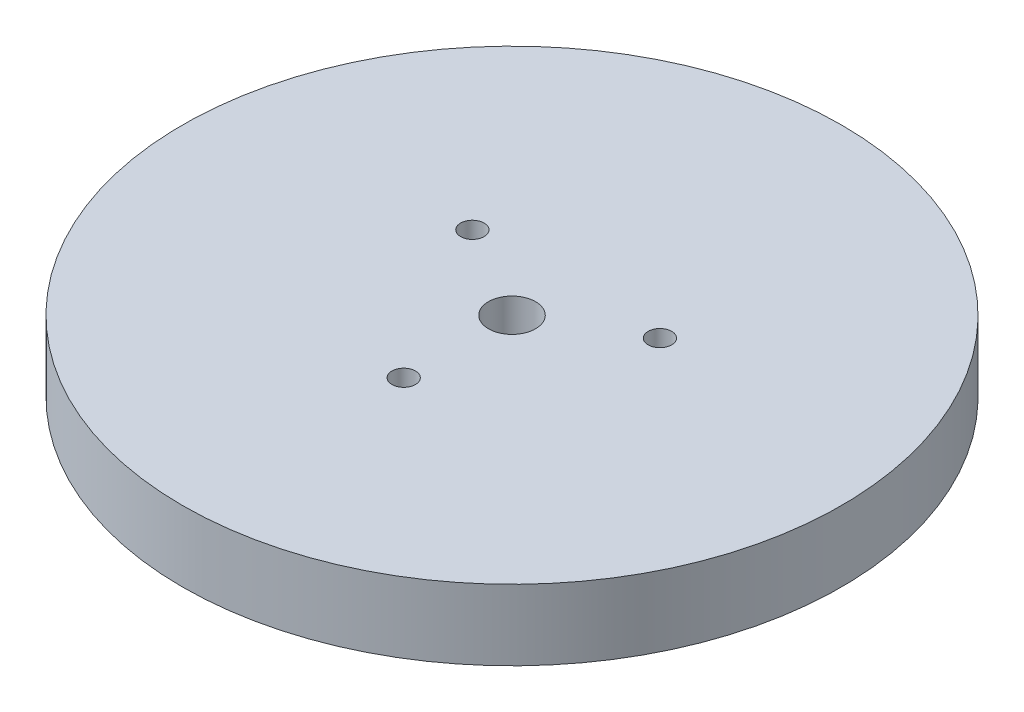
ISO-10303-21;
HEADER;
FILE_DESCRIPTION(('STEP AP214'),'2;1');
FILE_NAME('part.step','',(''),(''),'','','');
FILE_SCHEMA(('AUTOMOTIVE_DESIGN { 1 0 10303 214 1 1 1 1 }'));
ENDSEC;
DATA;
#1=APPLICATION_CONTEXT('core data for automotive mechanical design processes');
#2=APPLICATION_PROTOCOL_DEFINITION('international standard','automotive_design',2000,#1);
#3=PRODUCT_CONTEXT('',#1,'mechanical');
#4=PRODUCT('Part','Part','',(#3));
#5=PRODUCT_RELATED_PRODUCT_CATEGORY('part','',(#4));
#6=PRODUCT_DEFINITION_FORMATION('','',#4);
#7=PRODUCT_DEFINITION_CONTEXT('part definition',#1,'design');
#8=PRODUCT_DEFINITION('design','',#6,#7);
#9=PRODUCT_DEFINITION_SHAPE('','',#8);
#10=(LENGTH_UNIT() NAMED_UNIT(*) SI_UNIT(.MILLI.,.METRE.));
#11=(NAMED_UNIT(*) PLANE_ANGLE_UNIT() SI_UNIT($,.RADIAN.));
#12=(NAMED_UNIT(*) SI_UNIT($,.STERADIAN.) SOLID_ANGLE_UNIT());
#13=UNCERTAINTY_MEASURE_WITH_UNIT(LENGTH_MEASURE(1.E-05),#10,'distance_accuracy_value','');
#14=(GEOMETRIC_REPRESENTATION_CONTEXT(3) GLOBAL_UNCERTAINTY_ASSIGNED_CONTEXT((#13)) GLOBAL_UNIT_ASSIGNED_CONTEXT((#10,
#11,#12)) REPRESENTATION_CONTEXT('',''));
#15=CARTESIAN_POINT('',(0.,0.,0.));
#16=DIRECTION('',(0.,0.,1.));
#17=DIRECTION('',(1.,0.,0.));
#18=AXIS2_PLACEMENT_3D('',#15,#16,#17);
#19=CARTESIAN_POINT('',(0.,15.,0.));
#20=DIRECTION('',(0.,-1.,0.));
#21=DIRECTION('',(0.,0.,-1.));
#22=AXIS2_PLACEMENT_3D('',#19,#20,#21);
#23=CYLINDRICAL_SURFACE('',#22,70.);
#24=CARTESIAN_POINT('',(0.,15.,0.));
#25=DIRECTION('',(0.,1.,0.));
#26=DIRECTION('',(0.,0.,1.));
#27=AXIS2_PLACEMENT_3D('',#24,#25,#26);
#28=CIRCLE('',#27,70.);
#29=CARTESIAN_POINT('',(0.,15.,70.));
#30=VERTEX_POINT('',#29);
#31=EDGE_CURVE('E10',#30,#30,#28,.T.);
#32=ORIENTED_EDGE('',*,*,#31,.F.);
#33=EDGE_LOOP('',(#32));
#34=FACE_BOUND('',#33,.T.);
#35=CARTESIAN_POINT('',(0.,0.,0.));
#36=DIRECTION('',(0.,1.,0.));
#37=DIRECTION('',(0.,0.,1.));
#38=AXIS2_PLACEMENT_3D('',#35,#36,#37);
#39=CIRCLE('',#38,70.);
#40=CARTESIAN_POINT('',(0.,0.,70.));
#41=VERTEX_POINT('',#40);
#42=EDGE_CURVE('E36',#41,#41,#39,.T.);
#43=ORIENTED_EDGE('',*,*,#42,.T.);
#44=EDGE_LOOP('',(#43));
#45=FACE_BOUND('',#44,.T.);
#46=ADVANCED_FACE('F33',(#34,#45),#23,.T.);
#47=CARTESIAN_POINT('',(0.,15.,0.));
#48=DIRECTION('',(0.,1.,0.));
#49=DIRECTION('',(0.,0.,1.));
#50=AXIS2_PLACEMENT_3D('',#47,#48,#49);
#51=PLANE('',#50);
#52=CARTESIAN_POINT('',(0.,15.,23.));
#53=DIRECTION('',(0.,-1.,0.));
#54=DIRECTION('',(0.,0.,-1.));
#55=AXIS2_PLACEMENT_3D('',#52,#53,#54);
#56=CIRCLE('',#55,2.5);
#57=CARTESIAN_POINT('',(0.,15.,20.5));
#58=VERTEX_POINT('',#57);
#59=EDGE_CURVE('E48',#58,#58,#56,.T.);
#60=ORIENTED_EDGE('',*,*,#59,.T.);
#61=EDGE_LOOP('',(#60));
#62=FACE_BOUND('',#61,.T.);
#63=CARTESIAN_POINT('',(19.9185842870421,15.,-11.4999999999999));
#64=DIRECTION('',(0.,-1.,0.));
#65=DIRECTION('',(0.,0.,-1.));
#66=AXIS2_PLACEMENT_3D('',#63,#64,#65);
#67=CIRCLE('',#66,2.5);
#68=CARTESIAN_POINT('',(19.9185842870421,15.,-13.9999999999999));
#69=VERTEX_POINT('',#68);
#70=EDGE_CURVE('E60',#69,#69,#67,.T.);
#71=ORIENTED_EDGE('',*,*,#70,.T.);
#72=EDGE_LOOP('',(#71));
#73=FACE_BOUND('',#72,.T.);
#74=CARTESIAN_POINT('',(-19.9185842870421,15.,-11.5));
#75=DIRECTION('',(0.,-1.,0.));
#76=DIRECTION('',(0.,0.,-1.));
#77=AXIS2_PLACEMENT_3D('',#74,#75,#76);
#78=CIRCLE('',#77,2.5);
#79=CARTESIAN_POINT('',(-19.9185842870421,15.,-14.));
#80=VERTEX_POINT('',#79);
#81=EDGE_CURVE('E54',#80,#80,#78,.T.);
#82=ORIENTED_EDGE('',*,*,#81,.T.);
#83=EDGE_LOOP('',(#82));
#84=FACE_BOUND('',#83,.T.);
#85=CARTESIAN_POINT('',(0.,15.,0.));
#86=DIRECTION('',(0.,1.,0.));
#87=DIRECTION('',(0.,0.,1.));
#88=AXIS2_PLACEMENT_3D('',#85,#86,#87);
#89=CIRCLE('',#88,5.);
#90=CARTESIAN_POINT('',(0.,15.,5.));
#91=VERTEX_POINT('',#90);
#92=EDGE_CURVE('E45',#91,#91,#89,.T.);
#93=ORIENTED_EDGE('',*,*,#92,.F.);
#94=EDGE_LOOP('',(#93));
#95=FACE_BOUND('',#94,.T.);
#96=ORIENTED_EDGE('',*,*,#31,.T.);
#97=EDGE_LOOP('',(#96));
#98=FACE_BOUND('',#97,.T.);
#99=ADVANCED_FACE('F69',(#62,#73,#84,#95,#98),#51,.T.);
#100=CARTESIAN_POINT('',(0.,0.,0.));
#101=DIRECTION('',(0.,1.,0.));
#102=DIRECTION('',(0.,0.,1.));
#103=AXIS2_PLACEMENT_3D('',#100,#101,#102);
#104=PLANE('',#103);
#105=CARTESIAN_POINT('',(0.,0.,23.));
#106=DIRECTION('',(0.,-1.,0.));
#107=DIRECTION('',(0.,0.,-1.));
#108=AXIS2_PLACEMENT_3D('',#105,#106,#107);
#109=CIRCLE('',#108,2.5);
#110=CARTESIAN_POINT('',(0.,0.,20.5));
#111=VERTEX_POINT('',#110);
#112=EDGE_CURVE('E63',#111,#111,#109,.T.);
#113=ORIENTED_EDGE('',*,*,#112,.F.);
#114=EDGE_LOOP('',(#113));
#115=FACE_BOUND('',#114,.T.);
#116=CARTESIAN_POINT('',(19.9185842870421,0.,-11.4999999999999));
#117=DIRECTION('',(0.,-1.,0.));
#118=DIRECTION('',(0.,0.,-1.));
#119=AXIS2_PLACEMENT_3D('',#116,#117,#118);
#120=CIRCLE('',#119,2.5);
#121=CARTESIAN_POINT('',(19.9185842870421,0.,-13.9999999999999));
#122=VERTEX_POINT('',#121);
#123=EDGE_CURVE('E57',#122,#122,#120,.T.);
#124=ORIENTED_EDGE('',*,*,#123,.F.);
#125=EDGE_LOOP('',(#124));
#126=FACE_BOUND('',#125,.T.);
#127=CARTESIAN_POINT('',(-19.9185842870421,0.,-11.5));
#128=DIRECTION('',(0.,-1.,0.));
#129=DIRECTION('',(0.,0.,-1.));
#130=AXIS2_PLACEMENT_3D('',#127,#128,#129);
#131=CIRCLE('',#130,2.5);
#132=CARTESIAN_POINT('',(-19.9185842870421,0.,-14.));
#133=VERTEX_POINT('',#132);
#134=EDGE_CURVE('E51',#133,#133,#131,.T.);
#135=ORIENTED_EDGE('',*,*,#134,.F.);
#136=EDGE_LOOP('',(#135));
#137=FACE_BOUND('',#136,.T.);
#138=CARTESIAN_POINT('',(0.,0.,0.));
#139=DIRECTION('',(0.,1.,0.));
#140=DIRECTION('',(0.,0.,1.));
#141=AXIS2_PLACEMENT_3D('',#138,#139,#140);
#142=CIRCLE('',#141,5.);
#143=CARTESIAN_POINT('',(0.,0.,5.));
#144=VERTEX_POINT('',#143);
#145=EDGE_CURVE('E43',#144,#144,#142,.T.);
#146=ORIENTED_EDGE('',*,*,#145,.T.);
#147=EDGE_LOOP('',(#146));
#148=FACE_BOUND('',#147,.T.);
#149=ORIENTED_EDGE('',*,*,#42,.F.);
#150=EDGE_LOOP('',(#149));
#151=FACE_BOUND('',#150,.T.);
#152=ADVANCED_FACE('F79',(#115,#126,#137,#148,#151),#104,.F.);
#153=CARTESIAN_POINT('',(0.,0.,0.));
#154=DIRECTION('',(0.,1.,0.));
#155=DIRECTION('',(0.,0.,1.));
#156=AXIS2_PLACEMENT_3D('',#153,#154,#155);
#157=CYLINDRICAL_SURFACE('',#156,5.);
#158=ORIENTED_EDGE('',*,*,#145,.F.);
#159=EDGE_LOOP('',(#158));
#160=FACE_BOUND('',#159,.T.);
#161=ORIENTED_EDGE('',*,*,#92,.T.);
#162=EDGE_LOOP('',(#161));
#163=FACE_BOUND('',#162,.T.);
#164=ADVANCED_FACE('F82',(#160,#163),#157,.F.);
#165=CARTESIAN_POINT('',(-19.9185842870421,15.,-11.5));
#166=DIRECTION('',(0.,-1.,0.));
#167=DIRECTION('',(0.,0.,-1.));
#168=AXIS2_PLACEMENT_3D('',#165,#166,#167);
#169=CYLINDRICAL_SURFACE('',#168,2.5);
#170=ORIENTED_EDGE('',*,*,#81,.F.);
#171=EDGE_LOOP('',(#170));
#172=FACE_BOUND('',#171,.T.);
#173=ORIENTED_EDGE('',*,*,#134,.T.);
#174=EDGE_LOOP('',(#173));
#175=FACE_BOUND('',#174,.T.);
#176=ADVANCED_FACE('F102',(#172,#175),#169,.F.);
#177=CARTESIAN_POINT('',(19.9185842870421,15.,-11.4999999999999));
#178=DIRECTION('',(0.,-1.,0.));
#179=DIRECTION('',(0.,0.,-1.));
#180=AXIS2_PLACEMENT_3D('',#177,#178,#179);
#181=CYLINDRICAL_SURFACE('',#180,2.5);
#182=ORIENTED_EDGE('',*,*,#70,.F.);
#183=EDGE_LOOP('',(#182));
#184=FACE_BOUND('',#183,.T.);
#185=ORIENTED_EDGE('',*,*,#123,.T.);
#186=EDGE_LOOP('',(#185));
#187=FACE_BOUND('',#186,.T.);
#188=ADVANCED_FACE('F75',(#184,#187),#181,.F.);
#189=CARTESIAN_POINT('',(0.,15.,23.));
#190=DIRECTION('',(0.,-1.,0.));
#191=DIRECTION('',(0.,0.,-1.));
#192=AXIS2_PLACEMENT_3D('',#189,#190,#191);
#193=CYLINDRICAL_SURFACE('',#192,2.5);
#194=ORIENTED_EDGE('',*,*,#59,.F.);
#195=EDGE_LOOP('',(#194));
#196=FACE_BOUND('',#195,.T.);
#197=ORIENTED_EDGE('',*,*,#112,.T.);
#198=EDGE_LOOP('',(#197));
#199=FACE_BOUND('',#198,.T.);
#200=ADVANCED_FACE('F72',(#196,#199),#193,.F.);
#201=CLOSED_SHELL('',(#46,#99,#152,#164,#176,#188,#200));
#202=MANIFOLD_SOLID_BREP('B2',#201);
#203=ADVANCED_BREP_SHAPE_REPRESENTATION('',(#18,#202),#14);
#204=SHAPE_DEFINITION_REPRESENTATION(#9,#203);
ENDSEC;
END-ISO-10303-21;
